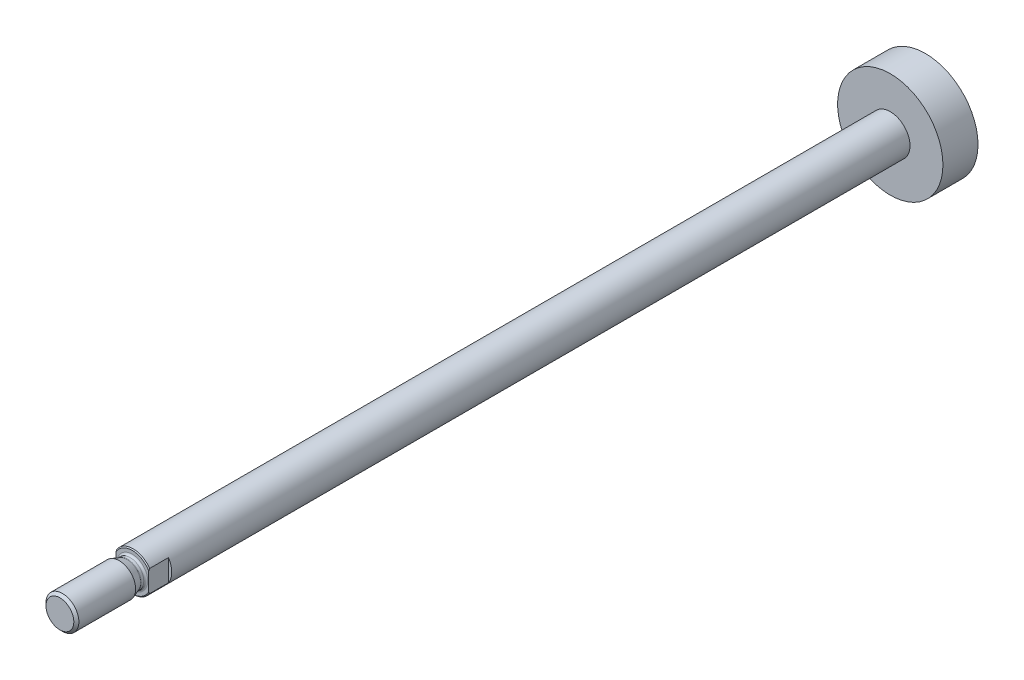
ISO-10303-21;
HEADER;
FILE_DESCRIPTION(('STEP AP214'),'2;1');
FILE_NAME('part.step','',(''),(''),'','','');
FILE_SCHEMA(('AUTOMOTIVE_DESIGN { 1 0 10303 214 1 1 1 1 }'));
ENDSEC;
DATA;
#1=APPLICATION_CONTEXT('core data for automotive mechanical design processes');
#2=APPLICATION_PROTOCOL_DEFINITION('international standard','automotive_design',2000,#1);
#3=PRODUCT_CONTEXT('',#1,'mechanical');
#4=PRODUCT('Part','Part','',(#3));
#5=PRODUCT_RELATED_PRODUCT_CATEGORY('part','',(#4));
#6=PRODUCT_DEFINITION_FORMATION('','',#4);
#7=PRODUCT_DEFINITION_CONTEXT('part definition',#1,'design');
#8=PRODUCT_DEFINITION('design','',#6,#7);
#9=PRODUCT_DEFINITION_SHAPE('','',#8);
#10=(LENGTH_UNIT() NAMED_UNIT(*) SI_UNIT(.MILLI.,.METRE.));
#11=(NAMED_UNIT(*) PLANE_ANGLE_UNIT() SI_UNIT($,.RADIAN.));
#12=(NAMED_UNIT(*) SI_UNIT($,.STERADIAN.) SOLID_ANGLE_UNIT());
#13=UNCERTAINTY_MEASURE_WITH_UNIT(LENGTH_MEASURE(1.E-05),#10,'distance_accuracy_value','');
#14=(GEOMETRIC_REPRESENTATION_CONTEXT(3) GLOBAL_UNCERTAINTY_ASSIGNED_CONTEXT((#13)) GLOBAL_UNIT_ASSIGNED_CONTEXT((#10,
#11,#12)) REPRESENTATION_CONTEXT('',''));
#15=CARTESIAN_POINT('',(0.,0.,0.));
#16=DIRECTION('',(0.,0.,1.));
#17=DIRECTION('',(1.,0.,0.));
#18=AXIS2_PLACEMENT_3D('',#15,#16,#17);
#19=CARTESIAN_POINT('',(0.,0.,24.817157287525));
#20=DIRECTION('',(0.,0.,-1.));
#21=DIRECTION('',(-1.,0.,0.));
#22=AXIS2_PLACEMENT_3D('',#19,#20,#21);
#23=CONICAL_SURFACE('',#22,6.,0.785398163396738);
#24=CARTESIAN_POINT('',(0.,0.,24.817157287525));
#25=DIRECTION('',(0.,0.,1.));
#26=DIRECTION('',(1.,0.,0.));
#27=AXIS2_PLACEMENT_3D('',#24,#25,#26);
#28=CIRCLE('',#27,6.);
#29=CARTESIAN_POINT('',(5.,3.3166247903554,24.817157287525));
#30=VERTEX_POINT('',#29);
#31=CARTESIAN_POINT('',(-5.,3.3166247903554,24.817157287525));
#32=VERTEX_POINT('',#31);
#33=EDGE_CURVE('E114',#30,#32,#28,.T.);
#34=ORIENTED_EDGE('',*,*,#33,.T.);
#35=CARTESIAN_POINT('',(-5.,3.3178909701797,24.816457287525));
#36=CARTESIAN_POINT('',(-5.,3.22895371576363,24.8656267093195));
#37=CARTESIAN_POINT('',(-5.,3.13944088512161,24.9137531024837));
#38=CARTESIAN_POINT('',(-5.,2.95914655519549,25.0076297832764));
#39=CARTESIAN_POINT('',(-5.,2.86836469775041,25.0533793821821));
#40=CARTESIAN_POINT('',(-5.,2.59331500087585,25.1869265574351));
#41=CARTESIAN_POINT('',(-5.,2.40702408998557,25.2706404424617));
#42=CARTESIAN_POINT('',(-5.,2.02692521382247,25.4247571798411));
#43=CARTESIAN_POINT('',(-5.,1.83306344865496,25.4950289860034));
#44=CARTESIAN_POINT('',(-5.,1.43985003442262,25.6173103819564));
#45=CARTESIAN_POINT('',(-5.,1.24050761098257,25.6693488505353));
#46=CARTESIAN_POINT('',(-5.,0.891758860999804,25.7403026094242));
#47=CARTESIAN_POINT('',(-5.,0.743400031731713,25.7643673951105));
#48=CARTESIAN_POINT('',(-5.,0.445117621418152,25.7995661437986));
#49=CARTESIAN_POINT('',(-5.,0.295193975417896,25.8106995678547));
#50=CARTESIAN_POINT('',(-5.,-0.00411102733939976,25.8193794859271));
#51=CARTESIAN_POINT('',(-5.,-0.153489896490867,25.8170106702113));
#52=CARTESIAN_POINT('',(-5.,-0.451437705367268,25.7990237430049));
#53=CARTESIAN_POINT('',(-5.,-0.600006594489138,25.783404813054));
#54=CARTESIAN_POINT('',(-5.,-0.932248425362132,25.7342660124564));
#55=CARTESIAN_POINT('',(-5.,-1.11540360961268,25.6972449762082));
#56=CARTESIAN_POINT('',(-5.,-1.477492649638,25.6063817745944));
#57=CARTESIAN_POINT('',(-5.,-1.65642422789305,25.5525307471261));
#58=CARTESIAN_POINT('',(-5.,-2.01037770007252,25.4307071011112));
#59=CARTESIAN_POINT('',(-5.,-2.18537452919222,25.3626627506687));
#60=CARTESIAN_POINT('',(-5.,-2.53051671842661,25.2154485763309));
#61=CARTESIAN_POINT('',(-5.,-2.70066339726442,25.1362818119299));
#62=CARTESIAN_POINT('',(-5.,-2.94452442049081,25.0149253515723));
#63=CARTESIAN_POINT('',(-5.,-3.02001003692978,24.9762341081614));
#64=CARTESIAN_POINT('',(-5.,-3.16975706861835,24.8974165116744));
#65=CARTESIAN_POINT('',(-5.,-3.24402266950494,24.8572981175936));
#66=CARTESIAN_POINT('',(-5.,-3.31789097017971,24.816457287525));
#67=B_SPLINE_CURVE_WITH_KNOTS('',3,(#35,#36,#37,#38,#39,#40,#41,#42,#43,#44,#45,#46,#47,#48,#49,
#50,#51,#52,#53,#54,#55,#56,#57,#58,#59,#60,#61,#62,#63,#64,#65,#66),.UNSPECIFIED.,.F.,.F.,(4,2,
2,2,2,2,2,2,2,2,2,2,2,2,2,4),(0.,0.304859061295259,0.609805974343282,1.22203927588654,
1.8399668895514,2.45691132969805,2.90730022188622,3.35770788444538,3.8052935708176,
4.2529069065904,4.81251735443629,5.37242297206069,5.93523001560882,6.49788254721102,
6.75233952500363,7.00554994677235),.UNSPECIFIED.);
#68=CARTESIAN_POINT('',(-5.,2.77234331393224,25.1));
#69=VERTEX_POINT('',#68);
#70=EDGE_CURVE('E126',#32,#69,#67,.T.);
#71=ORIENTED_EDGE('',*,*,#70,.T.);
#72=CARTESIAN_POINT('',(0.,0.,25.1));
#73=DIRECTION('',(0.,0.,1.));
#74=DIRECTION('',(1.,0.,0.));
#75=AXIS2_PLACEMENT_3D('',#72,#73,#74);
#76=CIRCLE('',#75,5.7171572875254);
#77=CARTESIAN_POINT('',(5.,2.77234331393224,25.1));
#78=VERTEX_POINT('',#77);
#79=EDGE_CURVE('E100',#78,#69,#76,.T.);
#80=ORIENTED_EDGE('',*,*,#79,.F.);
#81=CARTESIAN_POINT('',(5.,-3.3178909701797,24.816457287525));
#82=CARTESIAN_POINT('',(5.,-3.22895371576363,24.8656267093195));
#83=CARTESIAN_POINT('',(5.,-3.13944088512161,24.9137531024837));
#84=CARTESIAN_POINT('',(5.,-2.95914655519549,25.0076297832764));
#85=CARTESIAN_POINT('',(5.,-2.86836469775041,25.0533793821821));
#86=CARTESIAN_POINT('',(5.,-2.59331500087585,25.1869265574351));
#87=CARTESIAN_POINT('',(5.,-2.40702408998557,25.2706404424617));
#88=CARTESIAN_POINT('',(5.,-2.02692521382247,25.4247571798411));
#89=CARTESIAN_POINT('',(5.,-1.83306344865496,25.4950289860034));
#90=CARTESIAN_POINT('',(5.,-1.43985003442262,25.6173103819564));
#91=CARTESIAN_POINT('',(5.,-1.24050761098257,25.6693488505353));
#92=CARTESIAN_POINT('',(5.,-0.891758860999804,25.7403026094242));
#93=CARTESIAN_POINT('',(5.,-0.743400031731713,25.7643673951105));
#94=CARTESIAN_POINT('',(5.,-0.445117621418152,25.7995661437986));
#95=CARTESIAN_POINT('',(5.,-0.295193975417896,25.8106995678547));
#96=CARTESIAN_POINT('',(5.,0.00411102733939976,25.8193794859271));
#97=CARTESIAN_POINT('',(5.,0.153489896490867,25.8170106702113));
#98=CARTESIAN_POINT('',(5.,0.451437705367268,25.7990237430049));
#99=CARTESIAN_POINT('',(5.,0.600006594489138,25.783404813054));
#100=CARTESIAN_POINT('',(5.,0.932248425362132,25.7342660124564));
#101=CARTESIAN_POINT('',(5.,1.11540360961268,25.6972449762082));
#102=CARTESIAN_POINT('',(5.,1.477492649638,25.6063817745944));
#103=CARTESIAN_POINT('',(5.,1.65642422789305,25.5525307471261));
#104=CARTESIAN_POINT('',(5.,2.01037770007252,25.4307071011112));
#105=CARTESIAN_POINT('',(5.,2.18537452919222,25.3626627506687));
#106=CARTESIAN_POINT('',(5.,2.53051671842661,25.2154485763309));
#107=CARTESIAN_POINT('',(5.,2.70066339726442,25.1362818119299));
#108=CARTESIAN_POINT('',(5.,2.94452442049081,25.0149253515723));
#109=CARTESIAN_POINT('',(5.,3.02001003692978,24.9762341081614));
#110=CARTESIAN_POINT('',(5.,3.16975706861835,24.8974165116744));
#111=CARTESIAN_POINT('',(5.,3.24402266950494,24.8572981175936));
#112=CARTESIAN_POINT('',(5.,3.31789097017971,24.816457287525));
#113=B_SPLINE_CURVE_WITH_KNOTS('',3,(#81,#82,#83,#84,#85,#86,#87,#88,#89,#90,#91,#92,#93,#94,
#95,#96,#97,#98,#99,#100,#101,#102,#103,#104,#105,#106,#107,#108,#109,#110,#111,#112),
.UNSPECIFIED.,.F.,.F.,(4,2,2,2,2,2,2,2,2,2,2,2,2,2,2,4),(0.,0.304859061295259,0.609805974343282,
1.22203927588654,1.8399668895514,2.45691132969805,2.90730022188622,3.35770788444538,
3.8052935708176,4.2529069065904,4.81251735443629,5.37242297206069,5.93523001560882,
6.49788254721102,6.75233952500363,7.00554994677235),.UNSPECIFIED.);
#114=EDGE_CURVE('E128',#78,#30,#113,.T.);
#115=ORIENTED_EDGE('',*,*,#114,.T.);
#116=EDGE_LOOP('',(#34,#71,#80,#115));
#117=FACE_BOUND('',#116,.T.);
#118=ADVANCED_FACE('F43',(#117),#23,.T.);
#119=CARTESIAN_POINT('',(0.,0.,25.1));
#120=DIRECTION('',(0.,0.,-1.));
#121=DIRECTION('',(-1.,0.,0.));
#122=AXIS2_PLACEMENT_3D('',#119,#120,#121);
#123=PLANE('',#122);
#124=CARTESIAN_POINT('',(0.,0.,25.1));
#125=DIRECTION('',(0.,0.,1.));
#126=DIRECTION('',(1.,0.,0.));
#127=AXIS2_PLACEMENT_3D('',#124,#125,#126);
#128=CIRCLE('',#127,4.69999999999993);
#129=CARTESIAN_POINT('',(4.69999999999993,0.,25.1));
#130=VERTEX_POINT('',#129);
#131=EDGE_CURVE('E11',#130,#130,#128,.T.);
#132=ORIENTED_EDGE('',*,*,#131,.F.);
#133=EDGE_LOOP('',(#132));
#134=FACE_BOUND('',#133,.T.);
#135=ORIENTED_EDGE('',*,*,#79,.T.);
#136=DIRECTION('',(0.,-1.,0.));
#137=VECTOR('',#136,1.);
#138=CARTESIAN_POINT('',(-5.,0.,25.1));
#139=LINE('',#138,#137);
#140=CARTESIAN_POINT('',(-5.,-2.77234331393224,25.1));
#141=VERTEX_POINT('',#140);
#142=EDGE_CURVE('E140',#69,#141,#139,.T.);
#143=ORIENTED_EDGE('',*,*,#142,.T.);
#144=CARTESIAN_POINT('',(5.,-2.77234331393224,25.1));
#145=VERTEX_POINT('',#144);
#146=EDGE_CURVE('E129',#141,#145,#76,.T.);
#147=ORIENTED_EDGE('',*,*,#146,.T.);
#148=DIRECTION('',(0.,1.,0.));
#149=VECTOR('',#148,1.);
#150=CARTESIAN_POINT('',(5.,0.,25.1));
#151=LINE('',#150,#149);
#152=EDGE_CURVE('E142',#145,#78,#151,.T.);
#153=ORIENTED_EDGE('',*,*,#152,.T.);
#154=EDGE_LOOP('',(#135,#143,#147,#153));
#155=FACE_BOUND('',#154,.T.);
#156=ADVANCED_FACE('F45',(#134,#155),#123,.F.);
#157=ORIENTED_EDGE('',*,*,#146,.F.);
#158=CARTESIAN_POINT('',(-5.,-3.3166247903554,24.817157287525));
#159=VERTEX_POINT('',#158);
#160=EDGE_CURVE('E146',#141,#159,#67,.T.);
#161=ORIENTED_EDGE('',*,*,#160,.T.);
#162=CARTESIAN_POINT('',(5.,-3.3166247903554,24.817157287525));
#163=VERTEX_POINT('',#162);
#164=EDGE_CURVE('E130',#159,#163,#28,.T.);
#165=ORIENTED_EDGE('',*,*,#164,.T.);
#166=EDGE_CURVE('E144',#163,#145,#113,.T.);
#167=ORIENTED_EDGE('',*,*,#166,.T.);
#168=EDGE_LOOP('',(#157,#161,#165,#167));
#169=FACE_BOUND('',#168,.T.);
#170=ADVANCED_FACE('F162',(#169),#23,.T.);
#171=CARTESIAN_POINT('',(0.,0.,-216.));
#172=DIRECTION('',(0.,0.,1.));
#173=DIRECTION('',(1.,0.,0.));
#174=AXIS2_PLACEMENT_3D('',#171,#172,#173);
#175=CYLINDRICAL_SURFACE('',#174,6.);
#176=CARTESIAN_POINT('',(0.,0.,19.1));
#177=DIRECTION('',(0.,0.,-1.));
#178=DIRECTION('',(-1.,0.,0.));
#179=AXIS2_PLACEMENT_3D('',#176,#177,#178);
#180=CIRCLE('',#179,6.);
#181=CARTESIAN_POINT('',(-5.,-3.3166247903554,19.1));
#182=VERTEX_POINT('',#181);
#183=CARTESIAN_POINT('',(-5.,3.3166247903554,19.1));
#184=VERTEX_POINT('',#183);
#185=EDGE_CURVE('E122',#182,#184,#180,.T.);
#186=ORIENTED_EDGE('',*,*,#185,.T.);
#187=DIRECTION('',(0.,0.,1.));
#188=VECTOR('',#187,1.);
#189=CARTESIAN_POINT('',(-5.,3.3166247903554,-216.));
#190=LINE('',#189,#188);
#191=EDGE_CURVE('E51',#184,#32,#190,.T.);
#192=ORIENTED_EDGE('',*,*,#191,.T.);
#193=ORIENTED_EDGE('',*,*,#33,.F.);
#194=DIRECTION('',(0.,0.,1.));
#195=VECTOR('',#194,1.);
#196=CARTESIAN_POINT('',(5.,3.3166247903554,-216.));
#197=LINE('',#196,#195);
#198=CARTESIAN_POINT('',(5.,3.3166247903554,19.1));
#199=VERTEX_POINT('',#198);
#200=EDGE_CURVE('E99',#30,#199,#197,.F.);
#201=ORIENTED_EDGE('',*,*,#200,.T.);
#202=CARTESIAN_POINT('',(0.,0.,19.1));
#203=DIRECTION('',(0.,0.,-1.));
#204=DIRECTION('',(-1.,0.,0.));
#205=AXIS2_PLACEMENT_3D('',#202,#203,#204);
#206=CIRCLE('',#205,6.);
#207=CARTESIAN_POINT('',(5.,-3.3166247903554,19.1));
#208=VERTEX_POINT('',#207);
#209=EDGE_CURVE('E94',#199,#208,#206,.T.);
#210=ORIENTED_EDGE('',*,*,#209,.T.);
#211=DIRECTION('',(0.,0.,1.));
#212=VECTOR('',#211,1.);
#213=CARTESIAN_POINT('',(5.,-3.3166247903554,-216.));
#214=LINE('',#213,#212);
#215=EDGE_CURVE('E105',#208,#163,#214,.T.);
#216=ORIENTED_EDGE('',*,*,#215,.T.);
#217=ORIENTED_EDGE('',*,*,#164,.F.);
#218=DIRECTION('',(0.,0.,1.));
#219=VECTOR('',#218,1.);
#220=CARTESIAN_POINT('',(-5.,-3.3166247903554,-216.));
#221=LINE('',#220,#219);
#222=EDGE_CURVE('E116',#159,#182,#221,.F.);
#223=ORIENTED_EDGE('',*,*,#222,.T.);
#224=EDGE_LOOP('',(#186,#192,#193,#201,#210,#216,#217,#223));
#225=FACE_BOUND('',#224,.T.);
#226=CARTESIAN_POINT('',(0.,0.,-205.33333333333));
#227=DIRECTION('',(0.,0.,1.));
#228=DIRECTION('',(1.,0.,0.));
#229=AXIS2_PLACEMENT_3D('',#226,#227,#228);
#230=CIRCLE('',#229,6.);
#231=CARTESIAN_POINT('',(6.,0.,-205.33333333333));
#232=VERTEX_POINT('',#231);
#233=EDGE_CURVE('E134',#232,#232,#230,.T.);
#234=ORIENTED_EDGE('',*,*,#233,.T.);
#235=EDGE_LOOP('',(#234));
#236=FACE_BOUND('',#235,.T.);
#237=ADVANCED_FACE('F110',(#225,#236),#175,.T.);
#238=CARTESIAN_POINT('',(0.,6.,-205.33333333333));
#239=DIRECTION('',(0.,0.,-1.));
#240=DIRECTION('',(-1.,0.,0.));
#241=AXIS2_PLACEMENT_3D('',#238,#239,#240);
#242=PLANE('',#241);
#243=ORIENTED_EDGE('',*,*,#233,.F.);
#244=EDGE_LOOP('',(#243));
#245=FACE_BOUND('',#244,.T.);
#246=CARTESIAN_POINT('',(0.,0.,-205.33333333333));
#247=DIRECTION('',(0.,0.,1.));
#248=DIRECTION('',(1.,0.,0.));
#249=AXIS2_PLACEMENT_3D('',#246,#247,#248);
#250=CIRCLE('',#249,16.);
#251=CARTESIAN_POINT('',(16.,0.,-205.33333333333));
#252=VERTEX_POINT('',#251);
#253=EDGE_CURVE('E256',#252,#252,#250,.T.);
#254=ORIENTED_EDGE('',*,*,#253,.T.);
#255=EDGE_LOOP('',(#254));
#256=FACE_BOUND('',#255,.T.);
#257=ADVANCED_FACE('F184',(#245,#256),#242,.F.);
#258=CARTESIAN_POINT('',(0.,0.,-216.));
#259=DIRECTION('',(0.,0.,1.));
#260=DIRECTION('',(1.,0.,0.));
#261=AXIS2_PLACEMENT_3D('',#258,#259,#260);
#262=CYLINDRICAL_SURFACE('',#261,16.);
#263=ORIENTED_EDGE('',*,*,#253,.F.);
#264=EDGE_LOOP('',(#263));
#265=FACE_BOUND('',#264,.T.);
#266=CARTESIAN_POINT('',(0.,0.,-216.));
#267=DIRECTION('',(0.,0.,1.));
#268=DIRECTION('',(1.,0.,0.));
#269=AXIS2_PLACEMENT_3D('',#266,#267,#268);
#270=CIRCLE('',#269,16.);
#271=CARTESIAN_POINT('',(16.,0.,-216.));
#272=VERTEX_POINT('',#271);
#273=EDGE_CURVE('E254',#272,#272,#270,.T.);
#274=ORIENTED_EDGE('',*,*,#273,.T.);
#275=EDGE_LOOP('',(#274));
#276=FACE_BOUND('',#275,.T.);
#277=ADVANCED_FACE('F180',(#265,#276),#262,.T.);
#278=CARTESIAN_POINT('',(0.,16.,-216.));
#279=DIRECTION('',(0.,0.,1.));
#280=DIRECTION('',(1.,0.,0.));
#281=AXIS2_PLACEMENT_3D('',#278,#279,#280);
#282=PLANE('',#281);
#283=ORIENTED_EDGE('',*,*,#273,.F.);
#284=EDGE_LOOP('',(#283));
#285=FACE_BOUND('',#284,.T.);
#286=ADVANCED_FACE('F177',(#285),#282,.F.);
#287=CARTESIAN_POINT('',(10.,-10.,19.1));
#288=DIRECTION('',(0.,0.,-1.));
#289=DIRECTION('',(-1.,0.,0.));
#290=AXIS2_PLACEMENT_3D('',#287,#288,#289);
#291=PLANE('',#290);
#292=DIRECTION('',(0.,1.,0.));
#293=VECTOR('',#292,1.);
#294=CARTESIAN_POINT('',(5.,-10.,19.1));
#295=LINE('',#294,#293);
#296=EDGE_CURVE('E65',#208,#199,#295,.T.);
#297=ORIENTED_EDGE('',*,*,#296,.F.);
#298=ORIENTED_EDGE('',*,*,#209,.F.);
#299=EDGE_LOOP('',(#297,#298));
#300=FACE_BOUND('',#299,.T.);
#301=ADVANCED_FACE('F95',(#300),#291,.F.);
#302=CARTESIAN_POINT('',(5.,-10.,19.1));
#303=DIRECTION('',(-1.,0.,0.));
#304=DIRECTION('',(0.,0.,1.));
#305=AXIS2_PLACEMENT_3D('',#302,#303,#304);
#306=PLANE('',#305);
#307=ORIENTED_EDGE('',*,*,#296,.T.);
#308=ORIENTED_EDGE('',*,*,#200,.F.);
#309=ORIENTED_EDGE('',*,*,#114,.F.);
#310=ORIENTED_EDGE('',*,*,#152,.F.);
#311=ORIENTED_EDGE('',*,*,#166,.F.);
#312=ORIENTED_EDGE('',*,*,#215,.F.);
#313=EDGE_LOOP('',(#307,#308,#309,#310,#311,#312));
#314=FACE_BOUND('',#313,.T.);
#315=ADVANCED_FACE('F103',(#314),#306,.F.);
#316=CARTESIAN_POINT('',(-5.,-10.,19.1));
#317=DIRECTION('',(0.,0.,-1.));
#318=DIRECTION('',(-1.,0.,0.));
#319=AXIS2_PLACEMENT_3D('',#316,#317,#318);
#320=PLANE('',#319);
#321=DIRECTION('',(0.,1.,0.));
#322=VECTOR('',#321,1.);
#323=CARTESIAN_POINT('',(-5.,-10.,19.1));
#324=LINE('',#323,#322);
#325=EDGE_CURVE('E58',#182,#184,#324,.T.);
#326=ORIENTED_EDGE('',*,*,#325,.T.);
#327=ORIENTED_EDGE('',*,*,#185,.F.);
#328=EDGE_LOOP('',(#326,#327));
#329=FACE_BOUND('',#328,.T.);
#330=ADVANCED_FACE('F170',(#329),#320,.F.);
#331=CARTESIAN_POINT('',(-5.,-10.,31.1));
#332=DIRECTION('',(1.,0.,0.));
#333=DIRECTION('',(0.,0.,-1.));
#334=AXIS2_PLACEMENT_3D('',#331,#332,#333);
#335=PLANE('',#334);
#336=ORIENTED_EDGE('',*,*,#325,.F.);
#337=ORIENTED_EDGE('',*,*,#222,.F.);
#338=ORIENTED_EDGE('',*,*,#160,.F.);
#339=ORIENTED_EDGE('',*,*,#142,.F.);
#340=ORIENTED_EDGE('',*,*,#70,.F.);
#341=ORIENTED_EDGE('',*,*,#191,.F.);
#342=EDGE_LOOP('',(#336,#337,#338,#339,#340,#341));
#343=FACE_BOUND('',#342,.T.);
#344=ADVANCED_FACE('F165',(#343),#335,.F.);
#345=CARTESIAN_POINT('',(0.,0.,25.6999999999999));
#346=DIRECTION('',(0.,0.,1.));
#347=DIRECTION('',(1.,0.,0.));
#348=AXIS2_PLACEMENT_3D('',#345,#346,#347);
#349=TOROIDAL_SURFACE('',#348,4.69999999999993,0.599999999999928);
#350=CARTESIAN_POINT('',(0.,0.,25.7));
#351=DIRECTION('',(0.,0.,1.));
#352=DIRECTION('',(1.,0.,0.));
#353=AXIS2_PLACEMENT_3D('',#350,#351,#352);
#354=CIRCLE('',#353,4.1);
#355=CARTESIAN_POINT('',(4.1,0.,25.7));
#356=VERTEX_POINT('',#355);
#357=EDGE_CURVE('E106',#356,#356,#354,.T.);
#358=ORIENTED_EDGE('',*,*,#357,.F.);
#359=EDGE_LOOP('',(#358));
#360=FACE_BOUND('',#359,.T.);
#361=ORIENTED_EDGE('',*,*,#131,.T.);
#362=EDGE_LOOP('',(#361));
#363=FACE_BOUND('',#362,.T.);
#364=ADVANCED_FACE('F169',(#360,#363),#349,.F.);
#365=CARTESIAN_POINT('',(0.,0.,24.5));
#366=DIRECTION('',(0.,0.,1.));
#367=DIRECTION('',(1.,0.,0.));
#368=AXIS2_PLACEMENT_3D('',#365,#366,#367);
#369=CYLINDRICAL_SURFACE('',#368,4.1);
#370=CARTESIAN_POINT('',(0.,0.,26.494203811575));
#371=DIRECTION('',(0.,0.,1.));
#372=DIRECTION('',(1.,0.,0.));
#373=AXIS2_PLACEMENT_3D('',#370,#371,#372);
#374=CIRCLE('',#373,4.1);
#375=CARTESIAN_POINT('',(4.1,0.,26.494203811575));
#376=VERTEX_POINT('',#375);
#377=EDGE_CURVE('E247',#376,#376,#374,.T.);
#378=ORIENTED_EDGE('',*,*,#377,.F.);
#379=EDGE_LOOP('',(#378));
#380=FACE_BOUND('',#379,.T.);
#381=ORIENTED_EDGE('',*,*,#357,.T.);
#382=EDGE_LOOP('',(#381));
#383=FACE_BOUND('',#382,.T.);
#384=ADVANCED_FACE('F203',(#380,#383),#369,.T.);
#385=CARTESIAN_POINT('',(0.,0.,26.4942038115749));
#386=DIRECTION('',(0.,0.,1.));
#387=DIRECTION('',(1.,0.,0.));
#388=AXIS2_PLACEMENT_3D('',#385,#386,#387);
#389=TOROIDAL_SURFACE('',#388,4.69999999999744,0.599999999997442);
#390=CARTESIAN_POINT('',(0.,0.,26.6994158975694));
#391=DIRECTION('',(0.,0.,1.));
#392=DIRECTION('',(1.,0.,0.));
#393=AXIS2_PLACEMENT_3D('',#390,#391,#392);
#394=CIRCLE('',#393,4.13618442752829);
#395=CARTESIAN_POINT('',(4.13618442752829,0.,26.6994158975694));
#396=VERTEX_POINT('',#395);
#397=EDGE_CURVE('E244',#396,#396,#394,.T.);
#398=ORIENTED_EDGE('',*,*,#397,.F.);
#399=EDGE_LOOP('',(#398));
#400=FACE_BOUND('',#399,.T.);
#401=ORIENTED_EDGE('',*,*,#377,.T.);
#402=EDGE_LOOP('',(#401));
#403=FACE_BOUND('',#402,.T.);
#404=ADVANCED_FACE('F208',(#400,#403),#389,.F.);
#405=CARTESIAN_POINT('',(0.,0.,26.6994158975694));
#406=DIRECTION('',(0.,0.,1.));
#407=DIRECTION('',(1.,0.,0.));
#408=AXIS2_PLACEMENT_3D('',#405,#406,#407);
#409=CONICAL_SURFACE('',#408,4.13618442752829,0.349065850398827);
#410=CARTESIAN_POINT('',(0.,0.,29.072729677509));
#411=DIRECTION('',(0.,0.,1.));
#412=DIRECTION('',(1.,0.,0.));
#413=AXIS2_PLACEMENT_3D('',#410,#411,#412);
#414=CIRCLE('',#413,5.);
#415=CARTESIAN_POINT('',(5.,0.,29.072729677509));
#416=VERTEX_POINT('',#415);
#417=EDGE_CURVE('E239',#416,#416,#414,.T.);
#418=ORIENTED_EDGE('',*,*,#417,.F.);
#419=EDGE_LOOP('',(#418));
#420=FACE_BOUND('',#419,.T.);
#421=ORIENTED_EDGE('',*,*,#397,.T.);
#422=EDGE_LOOP('',(#421));
#423=FACE_BOUND('',#422,.T.);
#424=ADVANCED_FACE('F215',(#420,#423),#409,.T.);
#425=CARTESIAN_POINT('',(0.,0.,24.5));
#426=DIRECTION('',(0.,0.,1.));
#427=DIRECTION('',(1.,0.,0.));
#428=AXIS2_PLACEMENT_3D('',#425,#426,#427);
#429=CYLINDRICAL_SURFACE('',#428,5.);
#430=CARTESIAN_POINT('',(0.,0.,46.333));
#431=DIRECTION('',(0.,0.,1.));
#432=DIRECTION('',(1.,0.,0.));
#433=AXIS2_PLACEMENT_3D('',#430,#431,#432);
#434=CIRCLE('',#433,5.);
#435=CARTESIAN_POINT('',(5.,0.,46.333));
#436=VERTEX_POINT('',#435);
#437=EDGE_CURVE('E236',#436,#436,#434,.T.);
#438=ORIENTED_EDGE('',*,*,#437,.F.);
#439=EDGE_LOOP('',(#438));
#440=FACE_BOUND('',#439,.T.);
#441=ORIENTED_EDGE('',*,*,#417,.T.);
#442=EDGE_LOOP('',(#441));
#443=FACE_BOUND('',#442,.T.);
#444=ADVANCED_FACE('F219',(#440,#443),#429,.T.);
#445=CARTESIAN_POINT('',(0.,0.,46.333));
#446=DIRECTION('',(0.,0.,-1.));
#447=DIRECTION('',(-1.,0.,0.));
#448=AXIS2_PLACEMENT_3D('',#445,#446,#447);
#449=CONICAL_SURFACE('',#448,5.,0.785398163397446);
#450=CARTESIAN_POINT('',(0.,0.,47.1));
#451=DIRECTION('',(0.,0.,1.));
#452=DIRECTION('',(1.,0.,0.));
#453=AXIS2_PLACEMENT_3D('',#450,#451,#452);
#454=CIRCLE('',#453,4.233);
#455=CARTESIAN_POINT('',(4.233,0.,47.1));
#456=VERTEX_POINT('',#455);
#457=EDGE_CURVE('E235',#456,#456,#454,.T.);
#458=ORIENTED_EDGE('',*,*,#457,.F.);
#459=EDGE_LOOP('',(#458));
#460=FACE_BOUND('',#459,.T.);
#461=ORIENTED_EDGE('',*,*,#437,.T.);
#462=EDGE_LOOP('',(#461));
#463=FACE_BOUND('',#462,.T.);
#464=ADVANCED_FACE('F223',(#460,#463),#449,.T.);
#465=CARTESIAN_POINT('',(0.,0.,47.1));
#466=DIRECTION('',(0.,0.,-1.));
#467=DIRECTION('',(-1.,0.,0.));
#468=AXIS2_PLACEMENT_3D('',#465,#466,#467);
#469=PLANE('',#468);
#470=ORIENTED_EDGE('',*,*,#457,.T.);
#471=EDGE_LOOP('',(#470));
#472=FACE_BOUND('',#471,.T.);
#473=ADVANCED_FACE('F227',(#472),#469,.F.);
#474=CLOSED_SHELL('',(#118,#156,#170,#237,#257,#277,#286,#301,#315,#330,#344,#364,#384,#404,
#424,#444,#464,#473));
#475=MANIFOLD_SOLID_BREP('B2',#474);
#476=ADVANCED_BREP_SHAPE_REPRESENTATION('',(#18,#475),#14);
#477=SHAPE_DEFINITION_REPRESENTATION(#9,#476);
ENDSEC;
END-ISO-10303-21;
